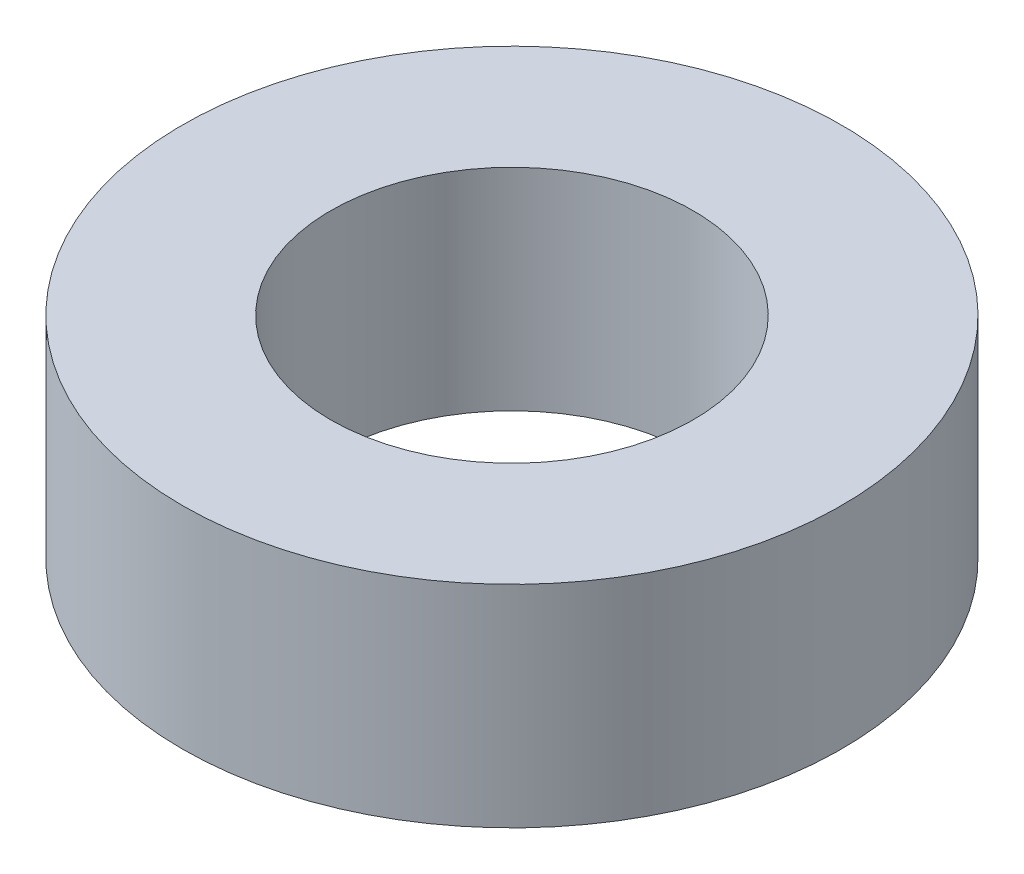
ISO-10303-21;
HEADER;
FILE_DESCRIPTION(('STEP AP214'),'2;1');
FILE_NAME('part.step','',(''),(''),'','','');
FILE_SCHEMA(('AUTOMOTIVE_DESIGN { 1 0 10303 214 1 1 1 1 }'));
ENDSEC;
DATA;
#1=APPLICATION_CONTEXT('core data for automotive mechanical design processes');
#2=APPLICATION_PROTOCOL_DEFINITION('international standard','automotive_design',2000,#1);
#3=PRODUCT_CONTEXT('',#1,'mechanical');
#4=PRODUCT('Part','Part','',(#3));
#5=PRODUCT_RELATED_PRODUCT_CATEGORY('part','',(#4));
#6=PRODUCT_DEFINITION_FORMATION('','',#4);
#7=PRODUCT_DEFINITION_CONTEXT('part definition',#1,'design');
#8=PRODUCT_DEFINITION('design','',#6,#7);
#9=PRODUCT_DEFINITION_SHAPE('','',#8);
#10=(LENGTH_UNIT() NAMED_UNIT(*) SI_UNIT(.MILLI.,.METRE.));
#11=(NAMED_UNIT(*) PLANE_ANGLE_UNIT() SI_UNIT($,.RADIAN.));
#12=(NAMED_UNIT(*) SI_UNIT($,.STERADIAN.) SOLID_ANGLE_UNIT());
#13=UNCERTAINTY_MEASURE_WITH_UNIT(LENGTH_MEASURE(1.E-05),#10,'distance_accuracy_value','');
#14=(GEOMETRIC_REPRESENTATION_CONTEXT(3) GLOBAL_UNCERTAINTY_ASSIGNED_CONTEXT((#13)) GLOBAL_UNIT_ASSIGNED_CONTEXT((#10,
#11,#12)) REPRESENTATION_CONTEXT('',''));
#15=CARTESIAN_POINT('',(0.,0.,0.));
#16=DIRECTION('',(0.,0.,1.));
#17=DIRECTION('',(1.,0.,0.));
#18=AXIS2_PLACEMENT_3D('',#15,#16,#17);
#19=CARTESIAN_POINT('',(0.,1.6,0.));
#20=DIRECTION('',(0.,1.,0.));
#21=DIRECTION('',(0.,0.,1.));
#22=AXIS2_PLACEMENT_3D('',#19,#20,#21);
#23=PLANE('',#22);
#24=CARTESIAN_POINT('',(0.,1.6,0.));
#25=DIRECTION('',(0.,1.,0.));
#26=DIRECTION('',(0.,0.,1.));
#27=AXIS2_PLACEMENT_3D('',#24,#25,#26);
#28=CIRCLE('',#27,5.);
#29=CARTESIAN_POINT('',(0.,1.6,5.));
#30=VERTEX_POINT('',#29);
#31=EDGE_CURVE('E10',#30,#30,#28,.T.);
#32=ORIENTED_EDGE('',*,*,#31,.T.);
#33=EDGE_LOOP('',(#32));
#34=FACE_BOUND('',#33,.T.);
#35=CARTESIAN_POINT('',(0.,1.6,0.));
#36=DIRECTION('',(0.,1.,0.));
#37=DIRECTION('',(0.,0.,1.));
#38=AXIS2_PLACEMENT_3D('',#35,#36,#37);
#39=CIRCLE('',#38,2.75);
#40=CARTESIAN_POINT('',(0.,1.6,2.75));
#41=VERTEX_POINT('',#40);
#42=EDGE_CURVE('E42',#41,#41,#39,.T.);
#43=ORIENTED_EDGE('',*,*,#42,.F.);
#44=EDGE_LOOP('',(#43));
#45=FACE_BOUND('',#44,.T.);
#46=ADVANCED_FACE('F31',(#34,#45),#23,.T.);
#47=CARTESIAN_POINT('',(0.,-1.6,0.));
#48=DIRECTION('',(0.,1.,0.));
#49=DIRECTION('',(0.,0.,1.));
#50=AXIS2_PLACEMENT_3D('',#47,#48,#49);
#51=PLANE('',#50);
#52=CARTESIAN_POINT('',(0.,-1.6,0.));
#53=DIRECTION('',(0.,1.,0.));
#54=DIRECTION('',(0.,0.,1.));
#55=AXIS2_PLACEMENT_3D('',#52,#53,#54);
#56=CIRCLE('',#55,5.);
#57=CARTESIAN_POINT('',(0.,-1.6,5.));
#58=VERTEX_POINT('',#57);
#59=EDGE_CURVE('E35',#58,#58,#56,.T.);
#60=ORIENTED_EDGE('',*,*,#59,.F.);
#61=EDGE_LOOP('',(#60));
#62=FACE_BOUND('',#61,.T.);
#63=CARTESIAN_POINT('',(0.,-1.6,0.));
#64=DIRECTION('',(0.,1.,0.));
#65=DIRECTION('',(0.,0.,1.));
#66=AXIS2_PLACEMENT_3D('',#63,#64,#65);
#67=CIRCLE('',#66,2.75);
#68=CARTESIAN_POINT('',(0.,-1.6,2.75));
#69=VERTEX_POINT('',#68);
#70=EDGE_CURVE('E44',#69,#69,#67,.T.);
#71=ORIENTED_EDGE('',*,*,#70,.T.);
#72=EDGE_LOOP('',(#71));
#73=FACE_BOUND('',#72,.T.);
#74=ADVANCED_FACE('F54',(#62,#73),#51,.F.);
#75=CARTESIAN_POINT('',(0.,1.6,0.));
#76=DIRECTION('',(0.,-1.,0.));
#77=DIRECTION('',(0.,0.,-1.));
#78=AXIS2_PLACEMENT_3D('',#75,#76,#77);
#79=CYLINDRICAL_SURFACE('',#78,5.);
#80=ORIENTED_EDGE('',*,*,#31,.F.);
#81=EDGE_LOOP('',(#80));
#82=FACE_BOUND('',#81,.T.);
#83=ORIENTED_EDGE('',*,*,#59,.T.);
#84=EDGE_LOOP('',(#83));
#85=FACE_BOUND('',#84,.T.);
#86=ADVANCED_FACE('F33',(#82,#85),#79,.T.);
#87=CARTESIAN_POINT('',(0.,1.6,0.));
#88=DIRECTION('',(0.,-1.,0.));
#89=DIRECTION('',(0.,0.,-1.));
#90=AXIS2_PLACEMENT_3D('',#87,#88,#89);
#91=CYLINDRICAL_SURFACE('',#90,2.75);
#92=ORIENTED_EDGE('',*,*,#42,.T.);
#93=EDGE_LOOP('',(#92));
#94=FACE_BOUND('',#93,.T.);
#95=ORIENTED_EDGE('',*,*,#70,.F.);
#96=EDGE_LOOP('',(#95));
#97=FACE_BOUND('',#96,.T.);
#98=ADVANCED_FACE('F50',(#94,#97),#91,.F.);
#99=CLOSED_SHELL('',(#46,#74,#86,#98));
#100=MANIFOLD_SOLID_BREP('B2',#99);
#101=ADVANCED_BREP_SHAPE_REPRESENTATION('',(#18,#100),#14);
#102=SHAPE_DEFINITION_REPRESENTATION(#9,#101);
ENDSEC;
END-ISO-10303-21;
